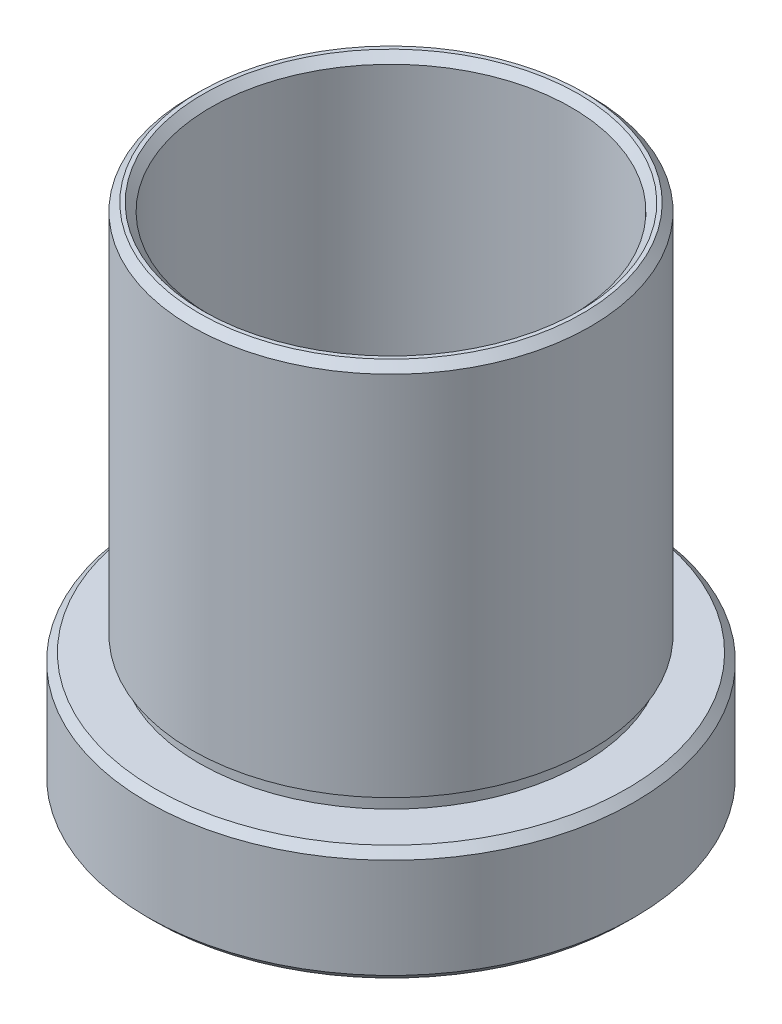
ISO-10303-21;
HEADER;
FILE_DESCRIPTION(('STEP AP214'),'2;1');
FILE_NAME('part.step','',(''),(''),'','','');
FILE_SCHEMA(('AUTOMOTIVE_DESIGN { 1 0 10303 214 1 1 1 1 }'));
ENDSEC;
DATA;
#1=APPLICATION_CONTEXT('core data for automotive mechanical design processes');
#2=APPLICATION_PROTOCOL_DEFINITION('international standard','automotive_design',2000,#1);
#3=PRODUCT_CONTEXT('',#1,'mechanical');
#4=PRODUCT('Part','Part','',(#3));
#5=PRODUCT_RELATED_PRODUCT_CATEGORY('part','',(#4));
#6=PRODUCT_DEFINITION_FORMATION('','',#4);
#7=PRODUCT_DEFINITION_CONTEXT('part definition',#1,'design');
#8=PRODUCT_DEFINITION('design','',#6,#7);
#9=PRODUCT_DEFINITION_SHAPE('','',#8);
#10=(LENGTH_UNIT() NAMED_UNIT(*) SI_UNIT(.MILLI.,.METRE.));
#11=(NAMED_UNIT(*) PLANE_ANGLE_UNIT() SI_UNIT($,.RADIAN.));
#12=(NAMED_UNIT(*) SI_UNIT($,.STERADIAN.) SOLID_ANGLE_UNIT());
#13=UNCERTAINTY_MEASURE_WITH_UNIT(LENGTH_MEASURE(1.E-05),#10,'distance_accuracy_value','');
#14=(GEOMETRIC_REPRESENTATION_CONTEXT(3) GLOBAL_UNCERTAINTY_ASSIGNED_CONTEXT((#13)) GLOBAL_UNIT_ASSIGNED_CONTEXT((#10,
#11,#12)) REPRESENTATION_CONTEXT('',''));
#15=CARTESIAN_POINT('',(0.,0.,0.));
#16=DIRECTION('',(0.,0.,1.));
#17=DIRECTION('',(1.,0.,0.));
#18=AXIS2_PLACEMENT_3D('',#15,#16,#17);
#19=CARTESIAN_POINT('',(13.,2.64285417456689,0.));
#20=DIRECTION('',(0.,1.,0.));
#21=DIRECTION('',(0.,0.,1.));
#22=AXIS2_PLACEMENT_3D('',#19,#20,#21);
#23=PLANE('',#22);
#24=CARTESIAN_POINT('',(0.,2.6428541745669,0.));
#25=DIRECTION('',(0.,1.,0.));
#26=DIRECTION('',(0.,0.,1.));
#27=AXIS2_PLACEMENT_3D('',#24,#25,#26);
#28=CIRCLE('',#27,13.);
#29=CARTESIAN_POINT('',(0.,2.6428541745669,13.));
#30=VERTEX_POINT('',#29);
#31=EDGE_CURVE('E10',#30,#30,#28,.T.);
#32=ORIENTED_EDGE('',*,*,#31,.F.);
#33=EDGE_LOOP('',(#32));
#34=FACE_BOUND('',#33,.T.);
#35=CARTESIAN_POINT('',(0.,2.6428541745669,0.));
#36=DIRECTION('',(0.,1.,0.));
#37=DIRECTION('',(0.,0.,1.));
#38=AXIS2_PLACEMENT_3D('',#35,#36,#37);
#39=CIRCLE('',#38,12.5);
#40=CARTESIAN_POINT('',(0.,2.6428541745669,12.5));
#41=VERTEX_POINT('',#40);
#42=EDGE_CURVE('E91',#41,#41,#39,.T.);
#43=ORIENTED_EDGE('',*,*,#42,.T.);
#44=EDGE_LOOP('',(#43));
#45=FACE_BOUND('',#44,.T.);
#46=ADVANCED_FACE('F36',(#34,#45),#23,.F.);
#47=CARTESIAN_POINT('',(0.,44.5985977452931,0.));
#48=DIRECTION('',(0.,1.,0.));
#49=DIRECTION('',(0.,0.,1.));
#50=AXIS2_PLACEMENT_3D('',#47,#48,#49);
#51=CYLINDRICAL_SURFACE('',#50,13.);
#52=CARTESIAN_POINT('',(0.,26.5428541745669,0.));
#53=DIRECTION('',(0.,1.,0.));
#54=DIRECTION('',(0.,0.,1.));
#55=AXIS2_PLACEMENT_3D('',#52,#53,#54);
#56=CIRCLE('',#55,13.);
#57=CARTESIAN_POINT('',(0.,26.5428541745669,13.));
#58=VERTEX_POINT('',#57);
#59=EDGE_CURVE('E42',#58,#58,#56,.T.);
#60=ORIENTED_EDGE('',*,*,#59,.F.);
#61=EDGE_LOOP('',(#60));
#62=FACE_BOUND('',#61,.T.);
#63=ORIENTED_EDGE('',*,*,#31,.T.);
#64=EDGE_LOOP('',(#63));
#65=FACE_BOUND('',#64,.T.);
#66=ADVANCED_FACE('F182',(#62,#65),#51,.T.);
#67=CARTESIAN_POINT('',(0.,26.5428541745669,0.));
#68=DIRECTION('',(0.,-1.,0.));
#69=DIRECTION('',(0.,0.,-1.));
#70=AXIS2_PLACEMENT_3D('',#67,#68,#69);
#71=CONICAL_SURFACE('',#70,13.,0.78539816339745);
#72=CARTESIAN_POINT('',(0.,27.0428541745669,0.));
#73=DIRECTION('',(0.,1.,0.));
#74=DIRECTION('',(0.,0.,1.));
#75=AXIS2_PLACEMENT_3D('',#72,#73,#74);
#76=CIRCLE('',#75,12.5);
#77=CARTESIAN_POINT('',(0.,27.0428541745669,12.5));
#78=VERTEX_POINT('',#77);
#79=EDGE_CURVE('E46',#78,#78,#76,.T.);
#80=ORIENTED_EDGE('',*,*,#79,.F.);
#81=EDGE_LOOP('',(#80));
#82=FACE_BOUND('',#81,.T.);
#83=ORIENTED_EDGE('',*,*,#59,.T.);
#84=EDGE_LOOP('',(#83));
#85=FACE_BOUND('',#84,.T.);
#86=ADVANCED_FACE('F177',(#82,#85),#71,.T.);
#87=CARTESIAN_POINT('',(12.25,27.0428541745669,0.));
#88=DIRECTION('',(0.,-1.,0.));
#89=DIRECTION('',(0.,0.,-1.));
#90=AXIS2_PLACEMENT_3D('',#87,#88,#89);
#91=PLANE('',#90);
#92=CARTESIAN_POINT('',(0.,27.0428541745669,0.));
#93=DIRECTION('',(0.,1.,0.));
#94=DIRECTION('',(0.,0.,1.));
#95=AXIS2_PLACEMENT_3D('',#92,#93,#94);
#96=CIRCLE('',#95,12.25);
#97=CARTESIAN_POINT('',(0.,27.0428541745669,12.25));
#98=VERTEX_POINT('',#97);
#99=EDGE_CURVE('E50',#98,#98,#96,.T.);
#100=ORIENTED_EDGE('',*,*,#99,.F.);
#101=EDGE_LOOP('',(#100));
#102=FACE_BOUND('',#101,.T.);
#103=ORIENTED_EDGE('',*,*,#79,.T.);
#104=EDGE_LOOP('',(#103));
#105=FACE_BOUND('',#104,.T.);
#106=ADVANCED_FACE('F171',(#102,#105),#91,.F.);
#107=CARTESIAN_POINT('',(0.,27.0428541745669,0.));
#108=DIRECTION('',(0.,1.,0.));
#109=DIRECTION('',(0.,0.,1.));
#110=AXIS2_PLACEMENT_3D('',#107,#108,#109);
#111=CONICAL_SURFACE('',#110,12.25,0.785398163397448);
#112=CARTESIAN_POINT('',(0.,26.5428541745669,0.));
#113=DIRECTION('',(0.,1.,0.));
#114=DIRECTION('',(0.,0.,1.));
#115=AXIS2_PLACEMENT_3D('',#112,#113,#114);
#116=CIRCLE('',#115,11.75);
#117=CARTESIAN_POINT('',(0.,26.5428541745669,11.75));
#118=VERTEX_POINT('',#117);
#119=EDGE_CURVE('E55',#118,#118,#116,.T.);
#120=ORIENTED_EDGE('',*,*,#119,.F.);
#121=EDGE_LOOP('',(#120));
#122=FACE_BOUND('',#121,.T.);
#123=ORIENTED_EDGE('',*,*,#99,.T.);
#124=EDGE_LOOP('',(#123));
#125=FACE_BOUND('',#124,.T.);
#126=ADVANCED_FACE('F165',(#122,#125),#111,.F.);
#127=CARTESIAN_POINT('',(0.,44.5985977452931,0.));
#128=DIRECTION('',(0.,1.,0.));
#129=DIRECTION('',(0.,0.,1.));
#130=AXIS2_PLACEMENT_3D('',#127,#128,#129);
#131=CYLINDRICAL_SURFACE('',#130,11.75);
#132=CARTESIAN_POINT('',(0.,-0.357145825433107,0.));
#133=DIRECTION('',(0.,1.,0.));
#134=DIRECTION('',(0.,0.,1.));
#135=AXIS2_PLACEMENT_3D('',#132,#133,#134);
#136=CIRCLE('',#135,11.75);
#137=CARTESIAN_POINT('',(0.,-0.357145825433107,11.75));
#138=VERTEX_POINT('',#137);
#139=EDGE_CURVE('E58',#138,#138,#136,.T.);
#140=ORIENTED_EDGE('',*,*,#139,.F.);
#141=EDGE_LOOP('',(#140));
#142=FACE_BOUND('',#141,.T.);
#143=ORIENTED_EDGE('',*,*,#119,.T.);
#144=EDGE_LOOP('',(#143));
#145=FACE_BOUND('',#144,.T.);
#146=ADVANCED_FACE('F159',(#142,#145),#131,.F.);
#147=CARTESIAN_POINT('',(14.35,-0.357145825433106,0.));
#148=DIRECTION('',(0.,1.,0.));
#149=DIRECTION('',(0.,0.,1.));
#150=AXIS2_PLACEMENT_3D('',#147,#148,#149);
#151=PLANE('',#150);
#152=CARTESIAN_POINT('',(0.,-0.357145825433107,0.));
#153=DIRECTION('',(0.,1.,0.));
#154=DIRECTION('',(0.,0.,1.));
#155=AXIS2_PLACEMENT_3D('',#152,#153,#154);
#156=CIRCLE('',#155,14.35);
#157=CARTESIAN_POINT('',(0.,-0.357145825433107,14.35));
#158=VERTEX_POINT('',#157);
#159=EDGE_CURVE('E61',#158,#158,#156,.T.);
#160=ORIENTED_EDGE('',*,*,#159,.F.);
#161=EDGE_LOOP('',(#160));
#162=FACE_BOUND('',#161,.T.);
#163=ORIENTED_EDGE('',*,*,#139,.T.);
#164=EDGE_LOOP('',(#163));
#165=FACE_BOUND('',#164,.T.);
#166=ADVANCED_FACE('F153',(#162,#165),#151,.F.);
#167=CARTESIAN_POINT('',(0.,44.5985977452931,0.));
#168=DIRECTION('',(0.,1.,0.));
#169=DIRECTION('',(0.,0.,1.));
#170=AXIS2_PLACEMENT_3D('',#167,#168,#169);
#171=CYLINDRICAL_SURFACE('',#170,14.35);
#172=CARTESIAN_POINT('',(0.,-1.35714582543311,0.));
#173=DIRECTION('',(0.,1.,0.));
#174=DIRECTION('',(0.,0.,1.));
#175=AXIS2_PLACEMENT_3D('',#172,#173,#174);
#176=CIRCLE('',#175,14.35);
#177=CARTESIAN_POINT('',(0.,-1.35714582543311,14.35));
#178=VERTEX_POINT('',#177);
#179=EDGE_CURVE('E64',#178,#178,#176,.T.);
#180=ORIENTED_EDGE('',*,*,#179,.F.);
#181=EDGE_LOOP('',(#180));
#182=FACE_BOUND('',#181,.T.);
#183=ORIENTED_EDGE('',*,*,#159,.T.);
#184=EDGE_LOOP('',(#183));
#185=FACE_BOUND('',#184,.T.);
#186=ADVANCED_FACE('F147',(#182,#185),#171,.F.);
#187=CARTESIAN_POINT('',(14.25,-1.35714582543311,0.));
#188=DIRECTION('',(0.,-1.,0.));
#189=DIRECTION('',(0.,0.,-1.));
#190=AXIS2_PLACEMENT_3D('',#187,#188,#189);
#191=PLANE('',#190);
#192=CARTESIAN_POINT('',(0.,-1.35714582543311,0.));
#193=DIRECTION('',(0.,1.,0.));
#194=DIRECTION('',(0.,0.,1.));
#195=AXIS2_PLACEMENT_3D('',#192,#193,#194);
#196=CIRCLE('',#195,14.25);
#197=CARTESIAN_POINT('',(0.,-1.35714582543311,14.25));
#198=VERTEX_POINT('',#197);
#199=EDGE_CURVE('E67',#198,#198,#196,.T.);
#200=ORIENTED_EDGE('',*,*,#199,.F.);
#201=EDGE_LOOP('',(#200));
#202=FACE_BOUND('',#201,.T.);
#203=ORIENTED_EDGE('',*,*,#179,.T.);
#204=EDGE_LOOP('',(#203));
#205=FACE_BOUND('',#204,.T.);
#206=ADVANCED_FACE('F141',(#202,#205),#191,.F.);
#207=CARTESIAN_POINT('',(0.,44.5985977452931,0.));
#208=DIRECTION('',(0.,1.,0.));
#209=DIRECTION('',(0.,0.,1.));
#210=AXIS2_PLACEMENT_3D('',#207,#208,#209);
#211=CYLINDRICAL_SURFACE('',#210,14.25);
#212=CARTESIAN_POINT('',(0.,-5.3571458254331,0.));
#213=DIRECTION('',(0.,1.,0.));
#214=DIRECTION('',(0.,0.,1.));
#215=AXIS2_PLACEMENT_3D('',#212,#213,#214);
#216=CIRCLE('',#215,14.25);
#217=CARTESIAN_POINT('',(0.,-5.3571458254331,14.25));
#218=VERTEX_POINT('',#217);
#219=EDGE_CURVE('E70',#218,#218,#216,.T.);
#220=ORIENTED_EDGE('',*,*,#219,.F.);
#221=EDGE_LOOP('',(#220));
#222=FACE_BOUND('',#221,.T.);
#223=ORIENTED_EDGE('',*,*,#199,.T.);
#224=EDGE_LOOP('',(#223));
#225=FACE_BOUND('',#224,.T.);
#226=ADVANCED_FACE('F135',(#222,#225),#211,.F.);
#227=CARTESIAN_POINT('',(0.,-5.3571458254331,0.));
#228=DIRECTION('',(0.,-1.,0.));
#229=DIRECTION('',(0.,0.,-1.));
#230=AXIS2_PLACEMENT_3D('',#227,#228,#229);
#231=CONICAL_SURFACE('',#230,14.25,0.785398163397452);
#232=CARTESIAN_POINT('',(0.,-5.85714582543311,0.));
#233=DIRECTION('',(0.,1.,0.));
#234=DIRECTION('',(0.,0.,1.));
#235=AXIS2_PLACEMENT_3D('',#232,#233,#234);
#236=CIRCLE('',#235,14.75);
#237=CARTESIAN_POINT('',(0.,-5.85714582543311,14.75));
#238=VERTEX_POINT('',#237);
#239=EDGE_CURVE('E73',#238,#238,#236,.T.);
#240=ORIENTED_EDGE('',*,*,#239,.F.);
#241=EDGE_LOOP('',(#240));
#242=FACE_BOUND('',#241,.T.);
#243=ORIENTED_EDGE('',*,*,#219,.T.);
#244=EDGE_LOOP('',(#243));
#245=FACE_BOUND('',#244,.T.);
#246=ADVANCED_FACE('F129',(#242,#245),#231,.F.);
#247=CARTESIAN_POINT('',(15.375,-5.8571458254331,0.));
#248=DIRECTION('',(0.,1.,0.));
#249=DIRECTION('',(0.,0.,1.));
#250=AXIS2_PLACEMENT_3D('',#247,#248,#249);
#251=PLANE('',#250);
#252=CARTESIAN_POINT('',(0.,-5.85714582543311,0.));
#253=DIRECTION('',(0.,1.,0.));
#254=DIRECTION('',(0.,0.,1.));
#255=AXIS2_PLACEMENT_3D('',#252,#253,#254);
#256=CIRCLE('',#255,15.375);
#257=CARTESIAN_POINT('',(0.,-5.85714582543311,15.375));
#258=VERTEX_POINT('',#257);
#259=EDGE_CURVE('E76',#258,#258,#256,.T.);
#260=ORIENTED_EDGE('',*,*,#259,.F.);
#261=EDGE_LOOP('',(#260));
#262=FACE_BOUND('',#261,.T.);
#263=ORIENTED_EDGE('',*,*,#239,.T.);
#264=EDGE_LOOP('',(#263));
#265=FACE_BOUND('',#264,.T.);
#266=ADVANCED_FACE('F123',(#262,#265),#251,.F.);
#267=CARTESIAN_POINT('',(0.,-5.85714582543311,0.));
#268=DIRECTION('',(0.,1.,0.));
#269=DIRECTION('',(0.,0.,1.));
#270=AXIS2_PLACEMENT_3D('',#267,#268,#269);
#271=CONICAL_SURFACE('',#270,15.375,0.785398163397448);
#272=CARTESIAN_POINT('',(0.,-5.3571458254331,0.));
#273=DIRECTION('',(0.,1.,0.));
#274=DIRECTION('',(0.,0.,1.));
#275=AXIS2_PLACEMENT_3D('',#272,#273,#274);
#276=CIRCLE('',#275,15.875);
#277=CARTESIAN_POINT('',(0.,-5.3571458254331,15.875));
#278=VERTEX_POINT('',#277);
#279=EDGE_CURVE('E79',#278,#278,#276,.T.);
#280=ORIENTED_EDGE('',*,*,#279,.F.);
#281=EDGE_LOOP('',(#280));
#282=FACE_BOUND('',#281,.T.);
#283=ORIENTED_EDGE('',*,*,#259,.T.);
#284=EDGE_LOOP('',(#283));
#285=FACE_BOUND('',#284,.T.);
#286=ADVANCED_FACE('F117',(#282,#285),#271,.T.);
#287=CARTESIAN_POINT('',(0.,44.5985977452931,0.));
#288=DIRECTION('',(0.,1.,0.));
#289=DIRECTION('',(0.,0.,1.));
#290=AXIS2_PLACEMENT_3D('',#287,#288,#289);
#291=CYLINDRICAL_SURFACE('',#290,15.875);
#292=CARTESIAN_POINT('',(0.,1.14285417456689,0.));
#293=DIRECTION('',(0.,1.,0.));
#294=DIRECTION('',(0.,0.,1.));
#295=AXIS2_PLACEMENT_3D('',#292,#293,#294);
#296=CIRCLE('',#295,15.875);
#297=CARTESIAN_POINT('',(0.,1.14285417456689,15.875));
#298=VERTEX_POINT('',#297);
#299=EDGE_CURVE('E82',#298,#298,#296,.T.);
#300=ORIENTED_EDGE('',*,*,#299,.F.);
#301=EDGE_LOOP('',(#300));
#302=FACE_BOUND('',#301,.T.);
#303=ORIENTED_EDGE('',*,*,#279,.T.);
#304=EDGE_LOOP('',(#303));
#305=FACE_BOUND('',#304,.T.);
#306=ADVANCED_FACE('F111',(#302,#305),#291,.T.);
#307=CARTESIAN_POINT('',(0.,1.14285417456689,0.));
#308=DIRECTION('',(0.,-1.,0.));
#309=DIRECTION('',(0.,0.,-1.));
#310=AXIS2_PLACEMENT_3D('',#307,#308,#309);
#311=CONICAL_SURFACE('',#310,15.875,0.785398163397445);
#312=CARTESIAN_POINT('',(0.,1.64285417456689,0.));
#313=DIRECTION('',(0.,1.,0.));
#314=DIRECTION('',(0.,0.,1.));
#315=AXIS2_PLACEMENT_3D('',#312,#313,#314);
#316=CIRCLE('',#315,15.375);
#317=CARTESIAN_POINT('',(0.,1.64285417456689,15.375));
#318=VERTEX_POINT('',#317);
#319=EDGE_CURVE('E85',#318,#318,#316,.T.);
#320=ORIENTED_EDGE('',*,*,#319,.F.);
#321=EDGE_LOOP('',(#320));
#322=FACE_BOUND('',#321,.T.);
#323=ORIENTED_EDGE('',*,*,#299,.T.);
#324=EDGE_LOOP('',(#323));
#325=FACE_BOUND('',#324,.T.);
#326=ADVANCED_FACE('F105',(#322,#325),#311,.T.);
#327=CARTESIAN_POINT('',(12.5,1.64285417456689,0.));
#328=DIRECTION('',(0.,-1.,0.));
#329=DIRECTION('',(0.,0.,-1.));
#330=AXIS2_PLACEMENT_3D('',#327,#328,#329);
#331=PLANE('',#330);
#332=CARTESIAN_POINT('',(0.,1.64285417456689,0.));
#333=DIRECTION('',(0.,1.,0.));
#334=DIRECTION('',(0.,0.,1.));
#335=AXIS2_PLACEMENT_3D('',#332,#333,#334);
#336=CIRCLE('',#335,12.5);
#337=CARTESIAN_POINT('',(0.,1.64285417456689,12.5));
#338=VERTEX_POINT('',#337);
#339=EDGE_CURVE('E88',#338,#338,#336,.T.);
#340=ORIENTED_EDGE('',*,*,#339,.F.);
#341=EDGE_LOOP('',(#340));
#342=FACE_BOUND('',#341,.T.);
#343=ORIENTED_EDGE('',*,*,#319,.T.);
#344=EDGE_LOOP('',(#343));
#345=FACE_BOUND('',#344,.T.);
#346=ADVANCED_FACE('F99',(#342,#345),#331,.F.);
#347=CARTESIAN_POINT('',(0.,44.5985977452931,0.));
#348=DIRECTION('',(0.,1.,0.));
#349=DIRECTION('',(0.,0.,1.));
#350=AXIS2_PLACEMENT_3D('',#347,#348,#349);
#351=CYLINDRICAL_SURFACE('',#350,12.5);
#352=ORIENTED_EDGE('',*,*,#42,.F.);
#353=EDGE_LOOP('',(#352));
#354=FACE_BOUND('',#353,.T.);
#355=ORIENTED_EDGE('',*,*,#339,.T.);
#356=EDGE_LOOP('',(#355));
#357=FACE_BOUND('',#356,.T.);
#358=ADVANCED_FACE('F96',(#354,#357),#351,.T.);
#359=CLOSED_SHELL('',(#46,#66,#86,#106,#126,#146,#166,#186,#206,#226,#246,#266,#286,#306,#326,
#346,#358));
#360=MANIFOLD_SOLID_BREP('B2',#359);
#361=ADVANCED_BREP_SHAPE_REPRESENTATION('',(#18,#360),#14);
#362=SHAPE_DEFINITION_REPRESENTATION(#9,#361);
ENDSEC;
END-ISO-10303-21;
